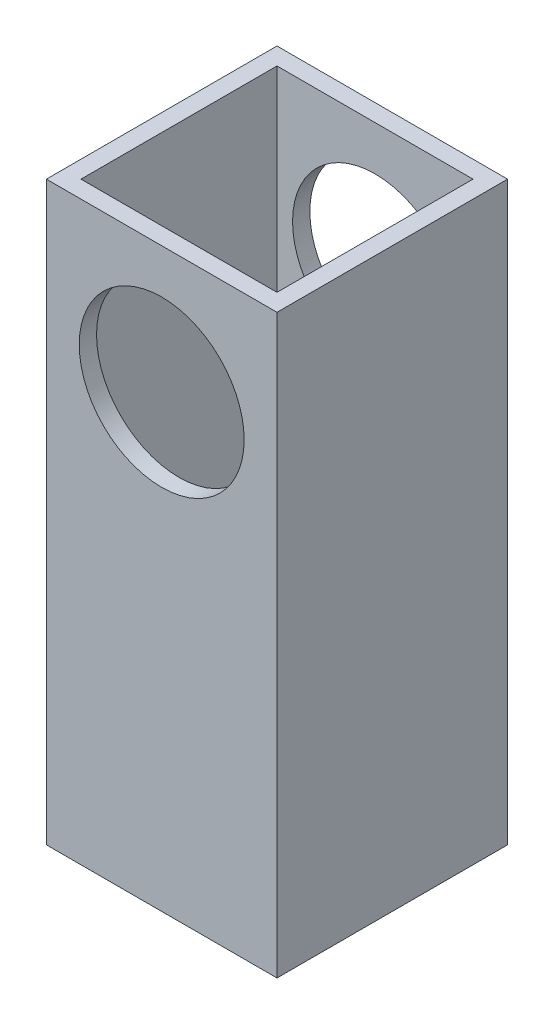
ISO-10303-21;
HEADER;
FILE_DESCRIPTION(('STEP AP214'),'2;1');
FILE_NAME('part.step','',(''),(''),'','','');
FILE_SCHEMA(('AUTOMOTIVE_DESIGN { 1 0 10303 214 1 1 1 1 }'));
ENDSEC;
DATA;
#1=APPLICATION_CONTEXT('core data for automotive mechanical design processes');
#2=APPLICATION_PROTOCOL_DEFINITION('international standard','automotive_design',2000,#1);
#3=PRODUCT_CONTEXT('',#1,'mechanical');
#4=PRODUCT('Part','Part','',(#3));
#5=PRODUCT_RELATED_PRODUCT_CATEGORY('part','',(#4));
#6=PRODUCT_DEFINITION_FORMATION('','',#4);
#7=PRODUCT_DEFINITION_CONTEXT('part definition',#1,'design');
#8=PRODUCT_DEFINITION('design','',#6,#7);
#9=PRODUCT_DEFINITION_SHAPE('','',#8);
#10=(LENGTH_UNIT() NAMED_UNIT(*) SI_UNIT(.MILLI.,.METRE.));
#11=(NAMED_UNIT(*) PLANE_ANGLE_UNIT() SI_UNIT($,.RADIAN.));
#12=(NAMED_UNIT(*) SI_UNIT($,.STERADIAN.) SOLID_ANGLE_UNIT());
#13=UNCERTAINTY_MEASURE_WITH_UNIT(LENGTH_MEASURE(1.E-05),#10,'distance_accuracy_value','');
#14=(GEOMETRIC_REPRESENTATION_CONTEXT(3) GLOBAL_UNCERTAINTY_ASSIGNED_CONTEXT((#13)) GLOBAL_UNIT_ASSIGNED_CONTEXT((#10,
#11,#12)) REPRESENTATION_CONTEXT('',''));
#15=CARTESIAN_POINT('',(0.,0.,0.));
#16=DIRECTION('',(0.,0.,1.));
#17=DIRECTION('',(1.,0.,0.));
#18=AXIS2_PLACEMENT_3D('',#15,#16,#17);
#19=CARTESIAN_POINT('',(0.,28.,0.));
#20=DIRECTION('',(0.,0.,1.));
#21=DIRECTION('',(1.,0.,0.));
#22=AXIS2_PLACEMENT_3D('',#19,#20,#21);
#23=CYLINDRICAL_SURFACE('',#22,14.3);
#24=CARTESIAN_POINT('',(0.,28.,37.));
#25=DIRECTION('',(0.,0.,1.));
#26=DIRECTION('',(1.,0.,0.));
#27=AXIS2_PLACEMENT_3D('',#24,#25,#26);
#28=CIRCLE('',#27,14.3);
#29=CARTESIAN_POINT('',(14.3,28.,37.));
#30=VERTEX_POINT('',#29);
#31=EDGE_CURVE('E37',#30,#30,#28,.F.);
#32=ORIENTED_EDGE('',*,*,#31,.T.);
#33=EDGE_LOOP('',(#32));
#34=FACE_BOUND('',#33,.T.);
#35=CARTESIAN_POINT('',(0.,28.,40.));
#36=DIRECTION('',(0.,0.,1.));
#37=DIRECTION('',(1.,0.,0.));
#38=AXIS2_PLACEMENT_3D('',#35,#36,#37);
#39=CIRCLE('',#38,14.3);
#40=CARTESIAN_POINT('',(14.3,28.,40.));
#41=VERTEX_POINT('',#40);
#42=EDGE_CURVE('E142',#41,#41,#39,.T.);
#43=ORIENTED_EDGE('',*,*,#42,.T.);
#44=EDGE_LOOP('',(#43));
#45=FACE_BOUND('',#44,.T.);
#46=ADVANCED_FACE('F33',(#34,#45),#23,.F.);
#47=CARTESIAN_POINT('',(-20.,-50.,40.));
#48=DIRECTION('',(1.,0.,0.));
#49=DIRECTION('',(0.,0.,-1.));
#50=AXIS2_PLACEMENT_3D('',#47,#48,#49);
#51=PLANE('',#50);
#52=DIRECTION('',(0.,-1.,0.));
#53=VECTOR('',#52,1.);
#54=CARTESIAN_POINT('',(-20.,-50.,0.));
#55=LINE('',#54,#53);
#56=CARTESIAN_POINT('',(-20.,50.,0.));
#57=VERTEX_POINT('',#56);
#58=CARTESIAN_POINT('',(-20.,-50.,0.));
#59=VERTEX_POINT('',#58);
#60=EDGE_CURVE('E141',#57,#59,#55,.T.);
#61=ORIENTED_EDGE('',*,*,#60,.T.);
#62=DIRECTION('',(0.,0.,-1.));
#63=VECTOR('',#62,1.);
#64=CARTESIAN_POINT('',(-20.,-50.,40.));
#65=LINE('',#64,#63);
#66=CARTESIAN_POINT('',(-20.,-50.,40.));
#67=VERTEX_POINT('',#66);
#68=EDGE_CURVE('E11',#67,#59,#65,.T.);
#69=ORIENTED_EDGE('',*,*,#68,.F.);
#70=DIRECTION('',(0.,-1.,0.));
#71=VECTOR('',#70,1.);
#72=CARTESIAN_POINT('',(-20.,-50.,40.));
#73=LINE('',#72,#71);
#74=CARTESIAN_POINT('',(-20.,50.,40.));
#75=VERTEX_POINT('',#74);
#76=EDGE_CURVE('E145',#75,#67,#73,.T.);
#77=ORIENTED_EDGE('',*,*,#76,.F.);
#78=DIRECTION('',(0.,0.,-1.));
#79=VECTOR('',#78,1.);
#80=CARTESIAN_POINT('',(-20.,50.,40.));
#81=LINE('',#80,#79);
#82=EDGE_CURVE('E155',#75,#57,#81,.T.);
#83=ORIENTED_EDGE('',*,*,#82,.T.);
#84=EDGE_LOOP('',(#61,#69,#77,#83));
#85=FACE_BOUND('',#84,.T.);
#86=ADVANCED_FACE('F35',(#85),#51,.F.);
#87=CARTESIAN_POINT('',(20.,-50.,40.));
#88=DIRECTION('',(0.,1.,0.));
#89=DIRECTION('',(-1.,0.,0.));
#90=AXIS2_PLACEMENT_3D('',#87,#88,#89);
#91=PLANE('',#90);
#92=DIRECTION('',(1.,0.,0.));
#93=VECTOR('',#92,1.);
#94=CARTESIAN_POINT('',(-17.,-50.,37.));
#95=LINE('',#94,#93);
#96=CARTESIAN_POINT('',(-17.,-50.,37.));
#97=VERTEX_POINT('',#96);
#98=CARTESIAN_POINT('',(17.,-50.,37.));
#99=VERTEX_POINT('',#98);
#100=EDGE_CURVE('E108',#97,#99,#95,.T.);
#101=ORIENTED_EDGE('',*,*,#100,.T.);
#102=DIRECTION('',(0.,0.,-1.));
#103=VECTOR('',#102,1.);
#104=CARTESIAN_POINT('',(17.,-50.,37.));
#105=LINE('',#104,#103);
#106=CARTESIAN_POINT('',(17.,-50.,3.));
#107=VERTEX_POINT('',#106);
#108=EDGE_CURVE('E102',#99,#107,#105,.T.);
#109=ORIENTED_EDGE('',*,*,#108,.T.);
#110=DIRECTION('',(-1.,0.,0.));
#111=VECTOR('',#110,1.);
#112=CARTESIAN_POINT('',(17.,-50.,3.));
#113=LINE('',#112,#111);
#114=CARTESIAN_POINT('',(-17.,-50.,3.));
#115=VERTEX_POINT('',#114);
#116=EDGE_CURVE('E111',#107,#115,#113,.T.);
#117=ORIENTED_EDGE('',*,*,#116,.T.);
#118=DIRECTION('',(0.,0.,1.));
#119=VECTOR('',#118,1.);
#120=CARTESIAN_POINT('',(-17.,-50.,3.));
#121=LINE('',#120,#119);
#122=EDGE_CURVE('E50',#115,#97,#121,.T.);
#123=ORIENTED_EDGE('',*,*,#122,.T.);
#124=EDGE_LOOP('',(#101,#109,#117,#123));
#125=FACE_BOUND('',#124,.T.);
#126=DIRECTION('',(1.,0.,0.));
#127=VECTOR('',#126,1.);
#128=CARTESIAN_POINT('',(20.,-50.,0.));
#129=LINE('',#128,#127);
#130=CARTESIAN_POINT('',(20.,-50.,0.));
#131=VERTEX_POINT('',#130);
#132=EDGE_CURVE('E158',#59,#131,#129,.T.);
#133=ORIENTED_EDGE('',*,*,#132,.T.);
#134=DIRECTION('',(0.,0.,-1.));
#135=VECTOR('',#134,1.);
#136=CARTESIAN_POINT('',(20.,-50.,40.));
#137=LINE('',#136,#135);
#138=CARTESIAN_POINT('',(20.,-50.,40.));
#139=VERTEX_POINT('',#138);
#140=EDGE_CURVE('E42',#139,#131,#137,.T.);
#141=ORIENTED_EDGE('',*,*,#140,.F.);
#142=DIRECTION('',(1.,0.,0.));
#143=VECTOR('',#142,1.);
#144=CARTESIAN_POINT('',(20.,-50.,40.));
#145=LINE('',#144,#143);
#146=EDGE_CURVE('E148',#67,#139,#145,.T.);
#147=ORIENTED_EDGE('',*,*,#146,.F.);
#148=ORIENTED_EDGE('',*,*,#68,.T.);
#149=EDGE_LOOP('',(#133,#141,#147,#148));
#150=FACE_BOUND('',#149,.T.);
#151=ADVANCED_FACE('F116',(#125,#150),#91,.F.);
#152=CARTESIAN_POINT('',(20.,-50.,40.));
#153=DIRECTION('',(-1.,0.,0.));
#154=DIRECTION('',(0.,0.,1.));
#155=AXIS2_PLACEMENT_3D('',#152,#153,#154);
#156=PLANE('',#155);
#157=DIRECTION('',(0.,1.,0.));
#158=VECTOR('',#157,1.);
#159=CARTESIAN_POINT('',(20.,-50.,0.));
#160=LINE('',#159,#158);
#161=CARTESIAN_POINT('',(20.,50.,0.));
#162=VERTEX_POINT('',#161);
#163=EDGE_CURVE('E160',#131,#162,#160,.T.);
#164=ORIENTED_EDGE('',*,*,#163,.T.);
#165=DIRECTION('',(0.,0.,-1.));
#166=VECTOR('',#165,1.);
#167=CARTESIAN_POINT('',(20.,50.,40.));
#168=LINE('',#167,#166);
#169=CARTESIAN_POINT('',(20.,50.,40.));
#170=VERTEX_POINT('',#169);
#171=EDGE_CURVE('E165',#170,#162,#168,.T.);
#172=ORIENTED_EDGE('',*,*,#171,.F.);
#173=DIRECTION('',(0.,1.,0.));
#174=VECTOR('',#173,1.);
#175=CARTESIAN_POINT('',(20.,-50.,40.));
#176=LINE('',#175,#174);
#177=EDGE_CURVE('E151',#139,#170,#176,.T.);
#178=ORIENTED_EDGE('',*,*,#177,.F.);
#179=ORIENTED_EDGE('',*,*,#140,.T.);
#180=EDGE_LOOP('',(#164,#172,#178,#179));
#181=FACE_BOUND('',#180,.T.);
#182=ADVANCED_FACE('F208',(#181),#156,.F.);
#183=CARTESIAN_POINT('',(20.,50.,40.));
#184=DIRECTION('',(0.,-1.,0.));
#185=DIRECTION('',(0.,0.,-1.));
#186=AXIS2_PLACEMENT_3D('',#183,#184,#185);
#187=PLANE('',#186);
#188=DIRECTION('',(-1.,0.,0.));
#189=VECTOR('',#188,1.);
#190=CARTESIAN_POINT('',(17.,50.,3.));
#191=LINE('',#190,#189);
#192=CARTESIAN_POINT('',(17.,50.,3.));
#193=VERTEX_POINT('',#192);
#194=CARTESIAN_POINT('',(-17.,50.,3.));
#195=VERTEX_POINT('',#194);
#196=EDGE_CURVE('E128',#193,#195,#191,.T.);
#197=ORIENTED_EDGE('',*,*,#196,.F.);
#198=DIRECTION('',(0.,0.,-1.));
#199=VECTOR('',#198,1.);
#200=CARTESIAN_POINT('',(17.,50.,37.));
#201=LINE('',#200,#199);
#202=CARTESIAN_POINT('',(17.,50.,37.));
#203=VERTEX_POINT('',#202);
#204=EDGE_CURVE('E58',#203,#193,#201,.T.);
#205=ORIENTED_EDGE('',*,*,#204,.F.);
#206=DIRECTION('',(1.,0.,0.));
#207=VECTOR('',#206,1.);
#208=CARTESIAN_POINT('',(-17.,50.,37.));
#209=LINE('',#208,#207);
#210=CARTESIAN_POINT('',(-17.,50.,37.));
#211=VERTEX_POINT('',#210);
#212=EDGE_CURVE('E119',#211,#203,#209,.T.);
#213=ORIENTED_EDGE('',*,*,#212,.F.);
#214=DIRECTION('',(0.,0.,1.));
#215=VECTOR('',#214,1.);
#216=CARTESIAN_POINT('',(-17.,50.,3.));
#217=LINE('',#216,#215);
#218=EDGE_CURVE('E122',#195,#211,#217,.T.);
#219=ORIENTED_EDGE('',*,*,#218,.F.);
#220=EDGE_LOOP('',(#197,#205,#213,#219));
#221=FACE_BOUND('',#220,.T.);
#222=DIRECTION('',(-1.,0.,0.));
#223=VECTOR('',#222,1.);
#224=CARTESIAN_POINT('',(20.,50.,0.));
#225=LINE('',#224,#223);
#226=EDGE_CURVE('E149',#162,#57,#225,.T.);
#227=ORIENTED_EDGE('',*,*,#226,.T.);
#228=ORIENTED_EDGE('',*,*,#82,.F.);
#229=DIRECTION('',(-1.,0.,0.));
#230=VECTOR('',#229,1.);
#231=CARTESIAN_POINT('',(20.,50.,40.));
#232=LINE('',#231,#230);
#233=EDGE_CURVE('E153',#170,#75,#232,.T.);
#234=ORIENTED_EDGE('',*,*,#233,.F.);
#235=ORIENTED_EDGE('',*,*,#171,.T.);
#236=EDGE_LOOP('',(#227,#228,#234,#235));
#237=FACE_BOUND('',#236,.T.);
#238=ADVANCED_FACE('F201',(#221,#237),#187,.F.);
#239=CARTESIAN_POINT('',(0.,0.,40.));
#240=DIRECTION('',(0.,0.,1.));
#241=DIRECTION('',(1.,0.,0.));
#242=AXIS2_PLACEMENT_3D('',#239,#240,#241);
#243=PLANE('',#242);
#244=ORIENTED_EDGE('',*,*,#42,.F.);
#245=EDGE_LOOP('',(#244));
#246=FACE_BOUND('',#245,.T.);
#247=ORIENTED_EDGE('',*,*,#76,.T.);
#248=ORIENTED_EDGE('',*,*,#146,.T.);
#249=ORIENTED_EDGE('',*,*,#177,.T.);
#250=ORIENTED_EDGE('',*,*,#233,.T.);
#251=EDGE_LOOP('',(#247,#248,#249,#250));
#252=FACE_BOUND('',#251,.T.);
#253=ADVANCED_FACE('F198',(#246,#252),#243,.T.);
#254=CARTESIAN_POINT('',(0.,0.,0.));
#255=DIRECTION('',(0.,0.,1.));
#256=DIRECTION('',(1.,0.,0.));
#257=AXIS2_PLACEMENT_3D('',#254,#255,#256);
#258=PLANE('',#257);
#259=CARTESIAN_POINT('',(0.,28.,0.));
#260=DIRECTION('',(0.,0.,1.));
#261=DIRECTION('',(1.,0.,0.));
#262=AXIS2_PLACEMENT_3D('',#259,#260,#261);
#263=CIRCLE('',#262,14.3);
#264=CARTESIAN_POINT('',(14.3,28.,0.));
#265=VERTEX_POINT('',#264);
#266=EDGE_CURVE('E138',#265,#265,#263,.T.);
#267=ORIENTED_EDGE('',*,*,#266,.T.);
#268=EDGE_LOOP('',(#267));
#269=FACE_BOUND('',#268,.T.);
#270=ORIENTED_EDGE('',*,*,#60,.F.);
#271=ORIENTED_EDGE('',*,*,#226,.F.);
#272=ORIENTED_EDGE('',*,*,#163,.F.);
#273=ORIENTED_EDGE('',*,*,#132,.F.);
#274=EDGE_LOOP('',(#270,#271,#272,#273));
#275=FACE_BOUND('',#274,.T.);
#276=ADVANCED_FACE('F187',(#269,#275),#258,.F.);
#277=CARTESIAN_POINT('',(0.,28.,3.));
#278=DIRECTION('',(0.,0.,-1.));
#279=DIRECTION('',(-1.,0.,0.));
#280=AXIS2_PLACEMENT_3D('',#277,#278,#279);
#281=CIRCLE('',#280,14.3);
#282=CARTESIAN_POINT('',(-14.3,28.,3.));
#283=VERTEX_POINT('',#282);
#284=EDGE_CURVE('E134',#283,#283,#281,.F.);
#285=ORIENTED_EDGE('',*,*,#284,.T.);
#286=EDGE_LOOP('',(#285));
#287=FACE_BOUND('',#286,.T.);
#288=ORIENTED_EDGE('',*,*,#266,.F.);
#289=EDGE_LOOP('',(#288));
#290=FACE_BOUND('',#289,.T.);
#291=ADVANCED_FACE('F179',(#287,#290),#23,.F.);
#292=CARTESIAN_POINT('',(-17.,-50.,37.));
#293=DIRECTION('',(0.,0.,1.));
#294=DIRECTION('',(1.,0.,0.));
#295=AXIS2_PLACEMENT_3D('',#292,#293,#294);
#296=PLANE('',#295);
#297=ORIENTED_EDGE('',*,*,#212,.T.);
#298=DIRECTION('',(0.,1.,0.));
#299=VECTOR('',#298,1.);
#300=CARTESIAN_POINT('',(17.,-50.,37.));
#301=LINE('',#300,#299);
#302=EDGE_CURVE('E132',#99,#203,#301,.T.);
#303=ORIENTED_EDGE('',*,*,#302,.F.);
#304=ORIENTED_EDGE('',*,*,#100,.F.);
#305=DIRECTION('',(0.,1.,0.));
#306=VECTOR('',#305,1.);
#307=CARTESIAN_POINT('',(-17.,-50.,37.));
#308=LINE('',#307,#306);
#309=EDGE_CURVE('E135',#97,#211,#308,.T.);
#310=ORIENTED_EDGE('',*,*,#309,.T.);
#311=EDGE_LOOP('',(#297,#303,#304,#310));
#312=FACE_BOUND('',#311,.T.);
#313=ORIENTED_EDGE('',*,*,#31,.F.);
#314=EDGE_LOOP('',(#313));
#315=FACE_BOUND('',#314,.T.);
#316=ADVANCED_FACE('F177',(#312,#315),#296,.F.);
#317=CARTESIAN_POINT('',(17.,-50.,3.));
#318=DIRECTION('',(0.,0.,-1.));
#319=DIRECTION('',(-1.,0.,0.));
#320=AXIS2_PLACEMENT_3D('',#317,#318,#319);
#321=PLANE('',#320);
#322=ORIENTED_EDGE('',*,*,#196,.T.);
#323=DIRECTION('',(0.,1.,0.));
#324=VECTOR('',#323,1.);
#325=CARTESIAN_POINT('',(-17.,-50.,3.));
#326=LINE('',#325,#324);
#327=EDGE_CURVE('E107',#115,#195,#326,.T.);
#328=ORIENTED_EDGE('',*,*,#327,.F.);
#329=ORIENTED_EDGE('',*,*,#116,.F.);
#330=DIRECTION('',(0.,1.,0.));
#331=VECTOR('',#330,1.);
#332=CARTESIAN_POINT('',(17.,-50.,3.));
#333=LINE('',#332,#331);
#334=EDGE_CURVE('E98',#107,#193,#333,.T.);
#335=ORIENTED_EDGE('',*,*,#334,.T.);
#336=EDGE_LOOP('',(#322,#328,#329,#335));
#337=FACE_BOUND('',#336,.T.);
#338=ORIENTED_EDGE('',*,*,#284,.F.);
#339=EDGE_LOOP('',(#338));
#340=FACE_BOUND('',#339,.T.);
#341=ADVANCED_FACE('F112',(#337,#340),#321,.F.);
#342=CARTESIAN_POINT('',(17.,-50.,37.));
#343=DIRECTION('',(1.,0.,0.));
#344=DIRECTION('',(0.,0.,-1.));
#345=AXIS2_PLACEMENT_3D('',#342,#343,#344);
#346=PLANE('',#345);
#347=ORIENTED_EDGE('',*,*,#204,.T.);
#348=ORIENTED_EDGE('',*,*,#334,.F.);
#349=ORIENTED_EDGE('',*,*,#108,.F.);
#350=ORIENTED_EDGE('',*,*,#302,.T.);
#351=EDGE_LOOP('',(#347,#348,#349,#350));
#352=FACE_BOUND('',#351,.T.);
#353=ADVANCED_FACE('F100',(#352),#346,.F.);
#354=CARTESIAN_POINT('',(-17.,-50.,3.));
#355=DIRECTION('',(-1.,0.,0.));
#356=DIRECTION('',(0.,0.,1.));
#357=AXIS2_PLACEMENT_3D('',#354,#355,#356);
#358=PLANE('',#357);
#359=ORIENTED_EDGE('',*,*,#218,.T.);
#360=ORIENTED_EDGE('',*,*,#309,.F.);
#361=ORIENTED_EDGE('',*,*,#122,.F.);
#362=ORIENTED_EDGE('',*,*,#327,.T.);
#363=EDGE_LOOP('',(#359,#360,#361,#362));
#364=FACE_BOUND('',#363,.T.);
#365=ADVANCED_FACE('F246',(#364),#358,.F.);
#366=CLOSED_SHELL('',(#46,#86,#151,#182,#238,#253,#276,#291,#316,#341,#353,#365));
#367=MANIFOLD_SOLID_BREP('B2',#366);
#368=ADVANCED_BREP_SHAPE_REPRESENTATION('',(#18,#367),#14);
#369=SHAPE_DEFINITION_REPRESENTATION(#9,#368);
ENDSEC;
END-ISO-10303-21;
